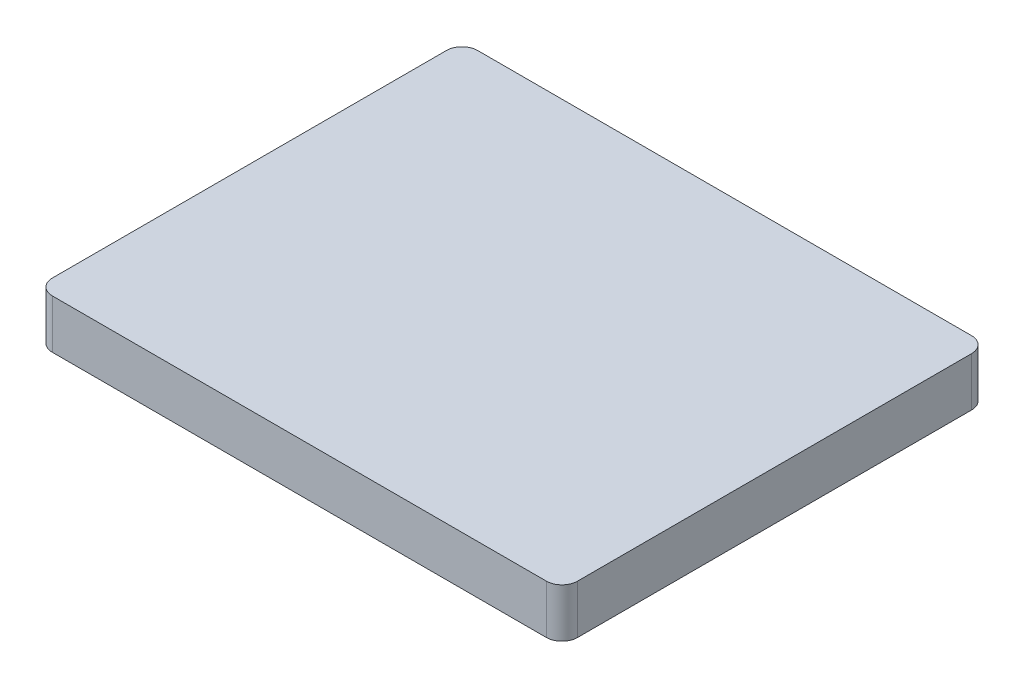
ISO-10303-21;
HEADER;
FILE_DESCRIPTION(('STEP AP214'),'2;1');
FILE_NAME('part.step','',(''),(''),'','','');
FILE_SCHEMA(('AUTOMOTIVE_DESIGN { 1 0 10303 214 1 1 1 1 }'));
ENDSEC;
DATA;
#1=APPLICATION_CONTEXT('core data for automotive mechanical design processes');
#2=APPLICATION_PROTOCOL_DEFINITION('international standard','automotive_design',2000,#1);
#3=PRODUCT_CONTEXT('',#1,'mechanical');
#4=PRODUCT('Part','Part','',(#3));
#5=PRODUCT_RELATED_PRODUCT_CATEGORY('part','',(#4));
#6=PRODUCT_DEFINITION_FORMATION('','',#4);
#7=PRODUCT_DEFINITION_CONTEXT('part definition',#1,'design');
#8=PRODUCT_DEFINITION('design','',#6,#7);
#9=PRODUCT_DEFINITION_SHAPE('','',#8);
#10=(LENGTH_UNIT() NAMED_UNIT(*) SI_UNIT(.MILLI.,.METRE.));
#11=(NAMED_UNIT(*) PLANE_ANGLE_UNIT() SI_UNIT($,.RADIAN.));
#12=(NAMED_UNIT(*) SI_UNIT($,.STERADIAN.) SOLID_ANGLE_UNIT());
#13=UNCERTAINTY_MEASURE_WITH_UNIT(LENGTH_MEASURE(1.E-05),#10,'distance_accuracy_value','');
#14=(GEOMETRIC_REPRESENTATION_CONTEXT(3) GLOBAL_UNCERTAINTY_ASSIGNED_CONTEXT((#13)) GLOBAL_UNIT_ASSIGNED_CONTEXT((#10,
#11,#12)) REPRESENTATION_CONTEXT('',''));
#15=CARTESIAN_POINT('',(0.,0.,0.));
#16=DIRECTION('',(0.,0.,1.));
#17=DIRECTION('',(1.,0.,0.));
#18=AXIS2_PLACEMENT_3D('',#15,#16,#17);
#19=CARTESIAN_POINT('',(10.875,17.7531010026189,8.375));
#20=DIRECTION('',(0.,1.,0.));
#21=DIRECTION('',(0.,0.,1.));
#22=AXIS2_PLACEMENT_3D('',#19,#20,#21);
#23=CYLINDRICAL_SURFACE('',#22,0.7);
#24=DIRECTION('',(0.,1.,0.));
#25=VECTOR('',#24,1.);
#26=CARTESIAN_POINT('',(10.875,17.7531010026189,9.075));
#27=LINE('',#26,#25);
#28=CARTESIAN_POINT('',(10.875,18.,9.075));
#29=VERTEX_POINT('',#28);
#30=CARTESIAN_POINT('',(10.875,20.2,9.075));
#31=VERTEX_POINT('',#30);
#32=EDGE_CURVE('E151',#29,#31,#27,.T.);
#33=ORIENTED_EDGE('',*,*,#32,.F.);
#34=CARTESIAN_POINT('',(10.875,18.,8.375));
#35=DIRECTION('',(0.,1.,0.));
#36=DIRECTION('',(0.,0.,1.));
#37=AXIS2_PLACEMENT_3D('',#34,#35,#36);
#38=CIRCLE('',#37,0.7);
#39=CARTESIAN_POINT('',(11.575,18.,8.375));
#40=VERTEX_POINT('',#39);
#41=EDGE_CURVE('E146',#29,#40,#38,.T.);
#42=ORIENTED_EDGE('',*,*,#41,.T.);
#43=DIRECTION('',(0.,1.,0.));
#44=VECTOR('',#43,1.);
#45=CARTESIAN_POINT('',(11.575,17.7531010026189,8.375));
#46=LINE('',#45,#44);
#47=CARTESIAN_POINT('',(11.575,20.2,8.375));
#48=VERTEX_POINT('',#47);
#49=EDGE_CURVE('E11',#40,#48,#46,.T.);
#50=ORIENTED_EDGE('',*,*,#49,.T.);
#51=CARTESIAN_POINT('',(10.875,20.2,8.375));
#52=DIRECTION('',(0.,1.,0.));
#53=DIRECTION('',(0.,0.,1.));
#54=AXIS2_PLACEMENT_3D('',#51,#52,#53);
#55=CIRCLE('',#54,0.7);
#56=EDGE_CURVE('E129',#48,#31,#55,.F.);
#57=ORIENTED_EDGE('',*,*,#56,.T.);
#58=EDGE_LOOP('',(#33,#42,#50,#57));
#59=FACE_BOUND('',#58,.T.);
#60=ADVANCED_FACE('F44',(#59),#23,.T.);
#61=CARTESIAN_POINT('',(-11.375,17.7531010026189,9.075));
#62=DIRECTION('',(0.,0.,1.));
#63=DIRECTION('',(1.,0.,0.));
#64=AXIS2_PLACEMENT_3D('',#61,#62,#63);
#65=PLANE('',#64);
#66=DIRECTION('',(0.,1.,0.));
#67=VECTOR('',#66,1.);
#68=CARTESIAN_POINT('',(-11.375,17.7531010026189,9.075));
#69=LINE('',#68,#67);
#70=CARTESIAN_POINT('',(-11.375,18.,9.075));
#71=VERTEX_POINT('',#70);
#72=CARTESIAN_POINT('',(-11.375,20.2,9.075));
#73=VERTEX_POINT('',#72);
#74=EDGE_CURVE('E153',#71,#73,#69,.T.);
#75=ORIENTED_EDGE('',*,*,#74,.F.);
#76=DIRECTION('',(1.,0.,0.));
#77=VECTOR('',#76,1.);
#78=CARTESIAN_POINT('',(0.,18.,9.075));
#79=LINE('',#78,#77);
#80=EDGE_CURVE('E143',#71,#29,#79,.T.);
#81=ORIENTED_EDGE('',*,*,#80,.T.);
#82=ORIENTED_EDGE('',*,*,#32,.T.);
#83=DIRECTION('',(-1.,0.,0.));
#84=VECTOR('',#83,1.);
#85=CARTESIAN_POINT('',(-0.25,20.2,9.075));
#86=LINE('',#85,#84);
#87=EDGE_CURVE('E132',#31,#73,#86,.T.);
#88=ORIENTED_EDGE('',*,*,#87,.T.);
#89=EDGE_LOOP('',(#75,#81,#82,#88));
#90=FACE_BOUND('',#89,.T.);
#91=ADVANCED_FACE('F196',(#90),#65,.T.);
#92=CARTESIAN_POINT('',(11.575,17.7531010026189,-9.375));
#93=DIRECTION('',(1.,0.,0.));
#94=DIRECTION('',(0.,0.,-1.));
#95=AXIS2_PLACEMENT_3D('',#92,#93,#94);
#96=PLANE('',#95);
#97=ORIENTED_EDGE('',*,*,#49,.F.);
#98=DIRECTION('',(0.,0.,-1.));
#99=VECTOR('',#98,1.);
#100=CARTESIAN_POINT('',(11.575,18.,0.));
#101=LINE('',#100,#99);
#102=CARTESIAN_POINT('',(11.575,18.,-9.375));
#103=VERTEX_POINT('',#102);
#104=EDGE_CURVE('E149',#40,#103,#101,.T.);
#105=ORIENTED_EDGE('',*,*,#104,.T.);
#106=DIRECTION('',(0.,1.,0.));
#107=VECTOR('',#106,1.);
#108=CARTESIAN_POINT('',(11.575,17.7531010026189,-9.375));
#109=LINE('',#108,#107);
#110=CARTESIAN_POINT('',(11.575,20.2,-9.375));
#111=VERTEX_POINT('',#110);
#112=EDGE_CURVE('E53',#103,#111,#109,.T.);
#113=ORIENTED_EDGE('',*,*,#112,.T.);
#114=DIRECTION('',(0.,0.,1.));
#115=VECTOR('',#114,1.);
#116=CARTESIAN_POINT('',(11.575,20.2,8.375));
#117=LINE('',#116,#115);
#118=EDGE_CURVE('E185',#111,#48,#117,.T.);
#119=ORIENTED_EDGE('',*,*,#118,.T.);
#120=EDGE_LOOP('',(#97,#105,#113,#119));
#121=FACE_BOUND('',#120,.T.);
#122=ADVANCED_FACE('F212',(#121),#96,.T.);
#123=CARTESIAN_POINT('',(10.875,17.7531010026189,-9.375));
#124=DIRECTION('',(0.,1.,0.));
#125=DIRECTION('',(0.,0.,1.));
#126=AXIS2_PLACEMENT_3D('',#123,#124,#125);
#127=CYLINDRICAL_SURFACE('',#126,0.699999999999999);
#128=ORIENTED_EDGE('',*,*,#112,.F.);
#129=CARTESIAN_POINT('',(10.875,18.,-9.375));
#130=DIRECTION('',(0.,1.,0.));
#131=DIRECTION('',(0.,0.,1.));
#132=AXIS2_PLACEMENT_3D('',#129,#130,#131);
#133=CIRCLE('',#132,0.699999999999999);
#134=CARTESIAN_POINT('',(10.875,18.,-10.075));
#135=VERTEX_POINT('',#134);
#136=EDGE_CURVE('E123',#103,#135,#133,.T.);
#137=ORIENTED_EDGE('',*,*,#136,.T.);
#138=DIRECTION('',(0.,1.,0.));
#139=VECTOR('',#138,1.);
#140=CARTESIAN_POINT('',(10.875,17.7531010026189,-10.075));
#141=LINE('',#140,#139);
#142=CARTESIAN_POINT('',(10.875,20.2,-10.075));
#143=VERTEX_POINT('',#142);
#144=EDGE_CURVE('E68',#135,#143,#141,.T.);
#145=ORIENTED_EDGE('',*,*,#144,.T.);
#146=CARTESIAN_POINT('',(10.875,20.2,-9.375));
#147=DIRECTION('',(0.,1.,0.));
#148=DIRECTION('',(0.,0.,1.));
#149=AXIS2_PLACEMENT_3D('',#146,#147,#148);
#150=CIRCLE('',#149,0.7);
#151=EDGE_CURVE('E117',#143,#111,#150,.F.);
#152=ORIENTED_EDGE('',*,*,#151,.T.);
#153=EDGE_LOOP('',(#128,#137,#145,#152));
#154=FACE_BOUND('',#153,.T.);
#155=ADVANCED_FACE('F128',(#154),#127,.T.);
#156=CARTESIAN_POINT('',(-12.075,17.7531010026189,-9.375));
#157=DIRECTION('',(-1.,0.,0.));
#158=DIRECTION('',(0.,0.,1.));
#159=AXIS2_PLACEMENT_3D('',#156,#157,#158);
#160=PLANE('',#159);
#161=DIRECTION('',(0.,1.,0.));
#162=VECTOR('',#161,1.);
#163=CARTESIAN_POINT('',(-12.075,17.7531010026189,-9.375));
#164=LINE('',#163,#162);
#165=CARTESIAN_POINT('',(-12.075,18.,-9.375));
#166=VERTEX_POINT('',#165);
#167=CARTESIAN_POINT('',(-12.075,20.2,-9.375));
#168=VERTEX_POINT('',#167);
#169=EDGE_CURVE('E161',#166,#168,#164,.T.);
#170=ORIENTED_EDGE('',*,*,#169,.F.);
#171=DIRECTION('',(0.,0.,1.));
#172=VECTOR('',#171,1.);
#173=CARTESIAN_POINT('',(-12.075,18.,0.));
#174=LINE('',#173,#172);
#175=CARTESIAN_POINT('',(-12.075,18.,8.375));
#176=VERTEX_POINT('',#175);
#177=EDGE_CURVE('E137',#166,#176,#174,.T.);
#178=ORIENTED_EDGE('',*,*,#177,.T.);
#179=DIRECTION('',(0.,1.,0.));
#180=VECTOR('',#179,1.);
#181=CARTESIAN_POINT('',(-12.075,17.7531010026189,8.375));
#182=LINE('',#181,#180);
#183=CARTESIAN_POINT('',(-12.075,20.2,8.375));
#184=VERTEX_POINT('',#183);
#185=EDGE_CURVE('E163',#176,#184,#182,.T.);
#186=ORIENTED_EDGE('',*,*,#185,.T.);
#187=DIRECTION('',(0.,0.,-1.));
#188=VECTOR('',#187,1.);
#189=CARTESIAN_POINT('',(-12.075,20.2,8.375));
#190=LINE('',#189,#188);
#191=EDGE_CURVE('E182',#184,#168,#190,.T.);
#192=ORIENTED_EDGE('',*,*,#191,.T.);
#193=EDGE_LOOP('',(#170,#178,#186,#192));
#194=FACE_BOUND('',#193,.T.);
#195=ADVANCED_FACE('F204',(#194),#160,.T.);
#196=CARTESIAN_POINT('',(-11.375,17.7531010026189,-9.375));
#197=DIRECTION('',(0.,1.,0.));
#198=DIRECTION('',(0.,0.,1.));
#199=AXIS2_PLACEMENT_3D('',#196,#197,#198);
#200=CYLINDRICAL_SURFACE('',#199,0.699999999999999);
#201=DIRECTION('',(0.,1.,0.));
#202=VECTOR('',#201,1.);
#203=CARTESIAN_POINT('',(-11.375,17.7531010026189,-10.075));
#204=LINE('',#203,#202);
#205=CARTESIAN_POINT('',(-11.375,18.,-10.075));
#206=VERTEX_POINT('',#205);
#207=CARTESIAN_POINT('',(-11.375,20.2,-10.075));
#208=VERTEX_POINT('',#207);
#209=EDGE_CURVE('E116',#206,#208,#204,.T.);
#210=ORIENTED_EDGE('',*,*,#209,.F.);
#211=CARTESIAN_POINT('',(-11.375,18.,-9.375));
#212=DIRECTION('',(0.,1.,0.));
#213=DIRECTION('',(0.,0.,1.));
#214=AXIS2_PLACEMENT_3D('',#211,#212,#213);
#215=CIRCLE('',#214,0.699999999999999);
#216=EDGE_CURVE('E126',#206,#166,#215,.T.);
#217=ORIENTED_EDGE('',*,*,#216,.T.);
#218=ORIENTED_EDGE('',*,*,#169,.T.);
#219=CARTESIAN_POINT('',(-11.375,20.2,-9.375));
#220=DIRECTION('',(0.,1.,0.));
#221=DIRECTION('',(0.,0.,1.));
#222=AXIS2_PLACEMENT_3D('',#219,#220,#221);
#223=CIRCLE('',#222,0.7);
#224=EDGE_CURVE('E176',#168,#208,#223,.F.);
#225=ORIENTED_EDGE('',*,*,#224,.T.);
#226=EDGE_LOOP('',(#210,#217,#218,#225));
#227=FACE_BOUND('',#226,.T.);
#228=ADVANCED_FACE('F177',(#227),#200,.T.);
#229=CARTESIAN_POINT('',(-11.375,17.7531010026189,8.375));
#230=DIRECTION('',(0.,1.,0.));
#231=DIRECTION('',(0.,0.,1.));
#232=AXIS2_PLACEMENT_3D('',#229,#230,#231);
#233=CYLINDRICAL_SURFACE('',#232,0.699999999999999);
#234=ORIENTED_EDGE('',*,*,#185,.F.);
#235=CARTESIAN_POINT('',(-11.375,18.,8.375));
#236=DIRECTION('',(0.,1.,0.));
#237=DIRECTION('',(0.,0.,1.));
#238=AXIS2_PLACEMENT_3D('',#235,#236,#237);
#239=CIRCLE('',#238,0.699999999999999);
#240=EDGE_CURVE('E140',#176,#71,#239,.T.);
#241=ORIENTED_EDGE('',*,*,#240,.T.);
#242=ORIENTED_EDGE('',*,*,#74,.T.);
#243=CARTESIAN_POINT('',(-11.375,20.2,8.375));
#244=DIRECTION('',(0.,1.,0.));
#245=DIRECTION('',(0.,0.,1.));
#246=AXIS2_PLACEMENT_3D('',#243,#244,#245);
#247=CIRCLE('',#246,0.7);
#248=EDGE_CURVE('E181',#73,#184,#247,.F.);
#249=ORIENTED_EDGE('',*,*,#248,.T.);
#250=EDGE_LOOP('',(#234,#241,#242,#249));
#251=FACE_BOUND('',#250,.T.);
#252=ADVANCED_FACE('F200',(#251),#233,.T.);
#253=CARTESIAN_POINT('',(-11.375,17.7531010026189,-10.075));
#254=DIRECTION('',(0.,0.,-1.));
#255=DIRECTION('',(-1.,0.,0.));
#256=AXIS2_PLACEMENT_3D('',#253,#254,#255);
#257=PLANE('',#256);
#258=ORIENTED_EDGE('',*,*,#144,.F.);
#259=DIRECTION('',(-1.,0.,0.));
#260=VECTOR('',#259,1.);
#261=CARTESIAN_POINT('',(0.,18.,-10.075));
#262=LINE('',#261,#260);
#263=EDGE_CURVE('E112',#135,#206,#262,.T.);
#264=ORIENTED_EDGE('',*,*,#263,.T.);
#265=ORIENTED_EDGE('',*,*,#209,.T.);
#266=DIRECTION('',(1.,0.,0.));
#267=VECTOR('',#266,1.);
#268=CARTESIAN_POINT('',(-0.25,20.2,-10.075));
#269=LINE('',#268,#267);
#270=EDGE_CURVE('E114',#208,#143,#269,.T.);
#271=ORIENTED_EDGE('',*,*,#270,.T.);
#272=EDGE_LOOP('',(#258,#264,#265,#271));
#273=FACE_BOUND('',#272,.T.);
#274=ADVANCED_FACE('F111',(#273),#257,.T.);
#275=CARTESIAN_POINT('',(0.,20.2,0.));
#276=DIRECTION('',(0.,1.,0.));
#277=DIRECTION('',(0.,0.,1.));
#278=AXIS2_PLACEMENT_3D('',#275,#276,#277);
#279=PLANE('',#278);
#280=ORIENTED_EDGE('',*,*,#270,.F.);
#281=ORIENTED_EDGE('',*,*,#224,.F.);
#282=ORIENTED_EDGE('',*,*,#191,.F.);
#283=ORIENTED_EDGE('',*,*,#248,.F.);
#284=ORIENTED_EDGE('',*,*,#87,.F.);
#285=ORIENTED_EDGE('',*,*,#56,.F.);
#286=ORIENTED_EDGE('',*,*,#118,.F.);
#287=ORIENTED_EDGE('',*,*,#151,.F.);
#288=EDGE_LOOP('',(#280,#281,#282,#283,#284,#285,#286,#287));
#289=FACE_BOUND('',#288,.T.);
#290=ADVANCED_FACE('F184',(#289),#279,.T.);
#291=CARTESIAN_POINT('',(0.,18.,0.));
#292=DIRECTION('',(0.,1.,0.));
#293=DIRECTION('',(1.,0.,0.));
#294=AXIS2_PLACEMENT_3D('',#291,#292,#293);
#295=PLANE('',#294);
#296=ORIENTED_EDGE('',*,*,#136,.F.);
#297=ORIENTED_EDGE('',*,*,#104,.F.);
#298=ORIENTED_EDGE('',*,*,#41,.F.);
#299=ORIENTED_EDGE('',*,*,#80,.F.);
#300=ORIENTED_EDGE('',*,*,#240,.F.);
#301=ORIENTED_EDGE('',*,*,#177,.F.);
#302=ORIENTED_EDGE('',*,*,#216,.F.);
#303=ORIENTED_EDGE('',*,*,#263,.F.);
#304=EDGE_LOOP('',(#296,#297,#298,#299,#300,#301,#302,#303));
#305=FACE_BOUND('',#304,.T.);
#306=ADVANCED_FACE('F46',(#305),#295,.F.);
#307=CLOSED_SHELL('',(#60,#91,#122,#155,#195,#228,#252,#274,#290,#306));
#308=MANIFOLD_SOLID_BREP('B2',#307);
#309=ADVANCED_BREP_SHAPE_REPRESENTATION('',(#18,#308),#14);
#310=SHAPE_DEFINITION_REPRESENTATION(#9,#309);
ENDSEC;
END-ISO-10303-21;
